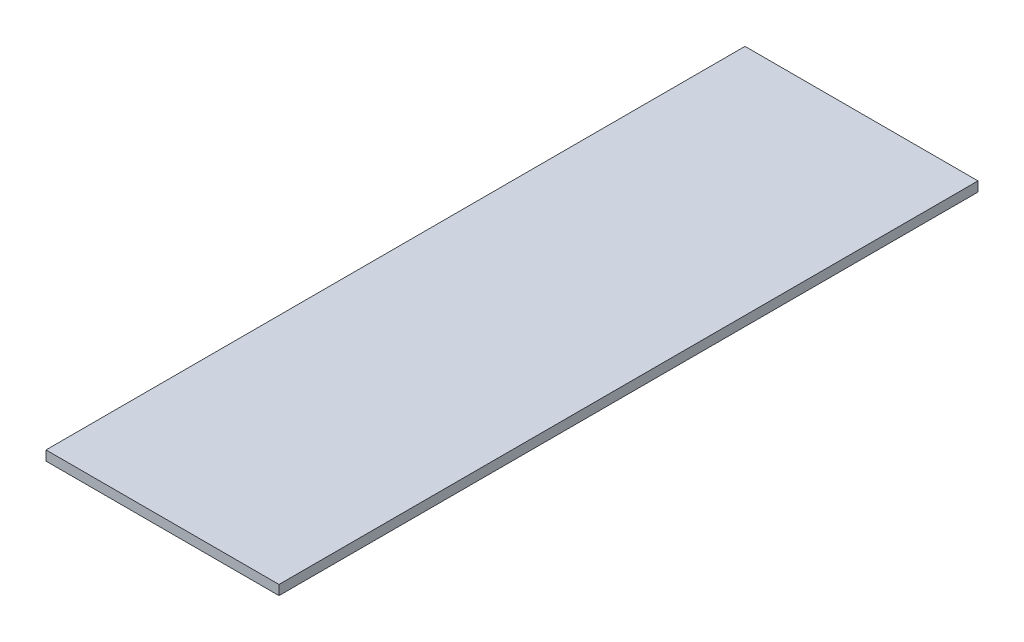
ISO-10303-21;
HEADER;
FILE_DESCRIPTION(('STEP AP214'),'2;1');
FILE_NAME('part.step','',(''),(''),'','','');
FILE_SCHEMA(('AUTOMOTIVE_DESIGN { 1 0 10303 214 1 1 1 1 }'));
ENDSEC;
DATA;
#1=APPLICATION_CONTEXT('core data for automotive mechanical design processes');
#2=APPLICATION_PROTOCOL_DEFINITION('international standard','automotive_design',2000,#1);
#3=PRODUCT_CONTEXT('',#1,'mechanical');
#4=PRODUCT('Part','Part','',(#3));
#5=PRODUCT_RELATED_PRODUCT_CATEGORY('part','',(#4));
#6=PRODUCT_DEFINITION_FORMATION('','',#4);
#7=PRODUCT_DEFINITION_CONTEXT('part definition',#1,'design');
#8=PRODUCT_DEFINITION('design','',#6,#7);
#9=PRODUCT_DEFINITION_SHAPE('','',#8);
#10=(LENGTH_UNIT() NAMED_UNIT(*) SI_UNIT(.MILLI.,.METRE.));
#11=(NAMED_UNIT(*) PLANE_ANGLE_UNIT() SI_UNIT($,.RADIAN.));
#12=(NAMED_UNIT(*) SI_UNIT($,.STERADIAN.) SOLID_ANGLE_UNIT());
#13=UNCERTAINTY_MEASURE_WITH_UNIT(LENGTH_MEASURE(1.E-05),#10,'distance_accuracy_value','');
#14=(GEOMETRIC_REPRESENTATION_CONTEXT(3) GLOBAL_UNCERTAINTY_ASSIGNED_CONTEXT((#13)) GLOBAL_UNIT_ASSIGNED_CONTEXT((#10,
#11,#12)) REPRESENTATION_CONTEXT('',''));
#15=CARTESIAN_POINT('',(0.,0.,0.));
#16=DIRECTION('',(0.,0.,1.));
#17=DIRECTION('',(1.,0.,0.));
#18=AXIS2_PLACEMENT_3D('',#15,#16,#17);
#19=CARTESIAN_POINT('',(152.4,6.34999999999986,457.199999999999));
#20=DIRECTION('',(-1.,0.,0.));
#21=DIRECTION('',(0.,0.,1.));
#22=AXIS2_PLACEMENT_3D('',#19,#20,#21);
#23=PLANE('',#22);
#24=DIRECTION('',(0.,0.,-1.));
#25=VECTOR('',#24,1.);
#26=CARTESIAN_POINT('',(152.4,-6.34999999999986,457.199999999999));
#27=LINE('',#26,#25);
#28=CARTESIAN_POINT('',(152.4,-6.34999999999986,457.199999999999));
#29=VERTEX_POINT('',#28);
#30=CARTESIAN_POINT('',(152.4,-6.34999999999986,-457.200000000001));
#31=VERTEX_POINT('',#30);
#32=EDGE_CURVE('E109',#29,#31,#27,.T.);
#33=ORIENTED_EDGE('',*,*,#32,.T.);
#34=DIRECTION('',(0.,-1.,0.));
#35=VECTOR('',#34,1.);
#36=CARTESIAN_POINT('',(152.4,6.34999999999986,-457.200000000001));
#37=LINE('',#36,#35);
#38=CARTESIAN_POINT('',(152.4,6.34999999999986,-457.200000000001));
#39=VERTEX_POINT('',#38);
#40=EDGE_CURVE('E11',#39,#31,#37,.T.);
#41=ORIENTED_EDGE('',*,*,#40,.F.);
#42=DIRECTION('',(0.,0.,-1.));
#43=VECTOR('',#42,1.);
#44=CARTESIAN_POINT('',(152.4,6.34999999999986,457.199999999999));
#45=LINE('',#44,#43);
#46=CARTESIAN_POINT('',(152.4,6.34999999999986,457.199999999999));
#47=VERTEX_POINT('',#46);
#48=EDGE_CURVE('E92',#47,#39,#45,.T.);
#49=ORIENTED_EDGE('',*,*,#48,.F.);
#50=DIRECTION('',(0.,-1.,0.));
#51=VECTOR('',#50,1.);
#52=CARTESIAN_POINT('',(152.4,6.34999999999986,457.199999999999));
#53=LINE('',#52,#51);
#54=EDGE_CURVE('E105',#47,#29,#53,.T.);
#55=ORIENTED_EDGE('',*,*,#54,.T.);
#56=EDGE_LOOP('',(#33,#41,#49,#55));
#57=FACE_BOUND('',#56,.T.);
#58=ADVANCED_FACE('F40',(#57),#23,.F.);
#59=CARTESIAN_POINT('',(-152.4,6.34999999999986,-457.199999999999));
#60=DIRECTION('',(0.,0.,1.));
#61=DIRECTION('',(1.,0.,0.));
#62=AXIS2_PLACEMENT_3D('',#59,#60,#61);
#63=PLANE('',#62);
#64=DIRECTION('',(-1.,0.,0.));
#65=VECTOR('',#64,1.);
#66=CARTESIAN_POINT('',(-152.4,-6.34999999999986,-457.199999999999));
#67=LINE('',#66,#65);
#68=CARTESIAN_POINT('',(-152.4,-6.34999999999986,-457.199999999999));
#69=VERTEX_POINT('',#68);
#70=EDGE_CURVE('E97',#31,#69,#67,.T.);
#71=ORIENTED_EDGE('',*,*,#70,.T.);
#72=DIRECTION('',(0.,-1.,0.));
#73=VECTOR('',#72,1.);
#74=CARTESIAN_POINT('',(-152.4,6.34999999999986,-457.199999999999));
#75=LINE('',#74,#73);
#76=CARTESIAN_POINT('',(-152.4,6.34999999999986,-457.199999999999));
#77=VERTEX_POINT('',#76);
#78=EDGE_CURVE('E49',#77,#69,#75,.T.);
#79=ORIENTED_EDGE('',*,*,#78,.F.);
#80=DIRECTION('',(-1.,0.,0.));
#81=VECTOR('',#80,1.);
#82=CARTESIAN_POINT('',(-152.4,6.34999999999986,-457.199999999999));
#83=LINE('',#82,#81);
#84=EDGE_CURVE('E87',#39,#77,#83,.T.);
#85=ORIENTED_EDGE('',*,*,#84,.F.);
#86=ORIENTED_EDGE('',*,*,#40,.T.);
#87=EDGE_LOOP('',(#71,#79,#85,#86));
#88=FACE_BOUND('',#87,.T.);
#89=ADVANCED_FACE('F96',(#88),#63,.F.);
#90=CARTESIAN_POINT('',(-152.4,6.34999999999986,457.200000000001));
#91=DIRECTION('',(1.,0.,0.));
#92=DIRECTION('',(0.,0.,-1.));
#93=AXIS2_PLACEMENT_3D('',#90,#91,#92);
#94=PLANE('',#93);
#95=DIRECTION('',(0.,0.,1.));
#96=VECTOR('',#95,1.);
#97=CARTESIAN_POINT('',(-152.4,-6.34999999999986,457.200000000001));
#98=LINE('',#97,#96);
#99=CARTESIAN_POINT('',(-152.4,-6.34999999999986,457.200000000001));
#100=VERTEX_POINT('',#99);
#101=EDGE_CURVE('E74',#69,#100,#98,.T.);
#102=ORIENTED_EDGE('',*,*,#101,.T.);
#103=DIRECTION('',(0.,-1.,0.));
#104=VECTOR('',#103,1.);
#105=CARTESIAN_POINT('',(-152.4,6.34999999999986,457.200000000001));
#106=LINE('',#105,#104);
#107=CARTESIAN_POINT('',(-152.4,6.34999999999986,457.200000000001));
#108=VERTEX_POINT('',#107);
#109=EDGE_CURVE('E99',#108,#100,#106,.T.);
#110=ORIENTED_EDGE('',*,*,#109,.F.);
#111=DIRECTION('',(0.,0.,1.));
#112=VECTOR('',#111,1.);
#113=CARTESIAN_POINT('',(-152.4,6.34999999999986,457.200000000001));
#114=LINE('',#113,#112);
#115=EDGE_CURVE('E90',#77,#108,#114,.T.);
#116=ORIENTED_EDGE('',*,*,#115,.F.);
#117=ORIENTED_EDGE('',*,*,#78,.T.);
#118=EDGE_LOOP('',(#102,#110,#116,#117));
#119=FACE_BOUND('',#118,.T.);
#120=ADVANCED_FACE('F100',(#119),#94,.F.);
#121=CARTESIAN_POINT('',(-152.4,6.34999999999986,457.200000000001));
#122=DIRECTION('',(0.,0.,-1.));
#123=DIRECTION('',(-1.,0.,0.));
#124=AXIS2_PLACEMENT_3D('',#121,#122,#123);
#125=PLANE('',#124);
#126=DIRECTION('',(1.,0.,0.));
#127=VECTOR('',#126,1.);
#128=CARTESIAN_POINT('',(-152.4,-6.34999999999986,457.200000000001));
#129=LINE('',#128,#127);
#130=EDGE_CURVE('E80',#100,#29,#129,.T.);
#131=ORIENTED_EDGE('',*,*,#130,.T.);
#132=ORIENTED_EDGE('',*,*,#54,.F.);
#133=DIRECTION('',(1.,0.,0.));
#134=VECTOR('',#133,1.);
#135=CARTESIAN_POINT('',(-152.4,6.34999999999986,457.200000000001));
#136=LINE('',#135,#134);
#137=EDGE_CURVE('E57',#108,#47,#136,.T.);
#138=ORIENTED_EDGE('',*,*,#137,.F.);
#139=ORIENTED_EDGE('',*,*,#109,.T.);
#140=EDGE_LOOP('',(#131,#132,#138,#139));
#141=FACE_BOUND('',#140,.T.);
#142=ADVANCED_FACE('F123',(#141),#125,.F.);
#143=CARTESIAN_POINT('',(0.,6.34999999999986,0.));
#144=DIRECTION('',(0.,-1.,0.));
#145=DIRECTION('',(0.,0.,-1.));
#146=AXIS2_PLACEMENT_3D('',#143,#144,#145);
#147=PLANE('',#146);
#148=ORIENTED_EDGE('',*,*,#48,.T.);
#149=ORIENTED_EDGE('',*,*,#84,.T.);
#150=ORIENTED_EDGE('',*,*,#115,.T.);
#151=ORIENTED_EDGE('',*,*,#137,.T.);
#152=EDGE_LOOP('',(#148,#149,#150,#151));
#153=FACE_BOUND('',#152,.T.);
#154=ADVANCED_FACE('F88',(#153),#147,.F.);
#155=CARTESIAN_POINT('',(0.,-6.34999999999986,0.));
#156=DIRECTION('',(0.,-1.,0.));
#157=DIRECTION('',(0.,0.,-1.));
#158=AXIS2_PLACEMENT_3D('',#155,#156,#157);
#159=PLANE('',#158);
#160=ORIENTED_EDGE('',*,*,#32,.F.);
#161=ORIENTED_EDGE('',*,*,#130,.F.);
#162=ORIENTED_EDGE('',*,*,#101,.F.);
#163=ORIENTED_EDGE('',*,*,#70,.F.);
#164=EDGE_LOOP('',(#160,#161,#162,#163));
#165=FACE_BOUND('',#164,.T.);
#166=ADVANCED_FACE('F126',(#165),#159,.T.);
#167=CLOSED_SHELL('',(#58,#89,#120,#142,#154,#166));
#168=MANIFOLD_SOLID_BREP('B2',#167);
#169=ADVANCED_BREP_SHAPE_REPRESENTATION('',(#18,#168),#14);
#170=SHAPE_DEFINITION_REPRESENTATION(#9,#169);
ENDSEC;
END-ISO-10303-21;
